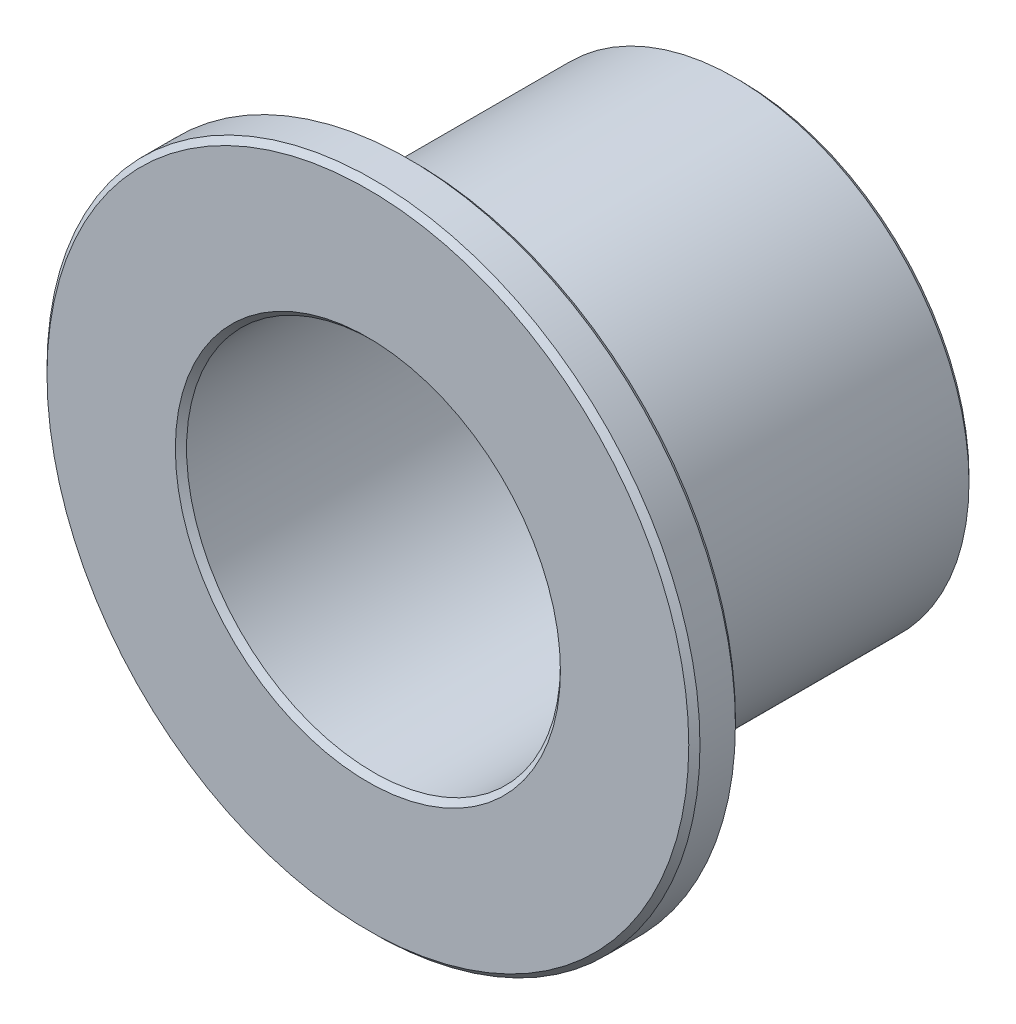
ISO-10303-21;
HEADER;
FILE_DESCRIPTION(('STEP AP214'),'2;1');
FILE_NAME('part.step','',(''),(''),'','','');
FILE_SCHEMA(('AUTOMOTIVE_DESIGN { 1 0 10303 214 1 1 1 1 }'));
ENDSEC;
DATA;
#1=APPLICATION_CONTEXT('core data for automotive mechanical design processes');
#2=APPLICATION_PROTOCOL_DEFINITION('international standard','automotive_design',2000,#1);
#3=PRODUCT_CONTEXT('',#1,'mechanical');
#4=PRODUCT('Part','Part','',(#3));
#5=PRODUCT_RELATED_PRODUCT_CATEGORY('part','',(#4));
#6=PRODUCT_DEFINITION_FORMATION('','',#4);
#7=PRODUCT_DEFINITION_CONTEXT('part definition',#1,'design');
#8=PRODUCT_DEFINITION('design','',#6,#7);
#9=PRODUCT_DEFINITION_SHAPE('','',#8);
#10=(LENGTH_UNIT() NAMED_UNIT(*) SI_UNIT(.MILLI.,.METRE.));
#11=(NAMED_UNIT(*) PLANE_ANGLE_UNIT() SI_UNIT($,.RADIAN.));
#12=(NAMED_UNIT(*) SI_UNIT($,.STERADIAN.) SOLID_ANGLE_UNIT());
#13=UNCERTAINTY_MEASURE_WITH_UNIT(LENGTH_MEASURE(1.E-05),#10,'distance_accuracy_value','');
#14=(GEOMETRIC_REPRESENTATION_CONTEXT(3) GLOBAL_UNCERTAINTY_ASSIGNED_CONTEXT((#13)) GLOBAL_UNIT_ASSIGNED_CONTEXT((#10,
#11,#12)) REPRESENTATION_CONTEXT('',''));
#15=CARTESIAN_POINT('',(0.,0.,0.));
#16=DIRECTION('',(0.,0.,1.));
#17=DIRECTION('',(1.,0.,0.));
#18=AXIS2_PLACEMENT_3D('',#15,#16,#17);
#19=CARTESIAN_POINT('',(0.,0.,4.7625));
#20=DIRECTION('',(0.,0.,1.));
#21=DIRECTION('',(1.,0.,0.));
#22=AXIS2_PLACEMENT_3D('',#19,#20,#21);
#23=CYLINDRICAL_SURFACE('',#22,11.1125);
#24=CARTESIAN_POINT('',(0.,0.,6.159119));
#25=DIRECTION('',(0.,0.,1.));
#26=DIRECTION('',(1.,0.,0.));
#27=AXIS2_PLACEMENT_3D('',#24,#25,#26);
#28=CIRCLE('',#27,11.1125);
#29=CARTESIAN_POINT('',(11.1125,0.,6.159119));
#30=VERTEX_POINT('',#29);
#31=EDGE_CURVE('E71',#30,#30,#28,.F.);
#32=ORIENTED_EDGE('',*,*,#31,.T.);
#33=EDGE_LOOP('',(#32));
#34=FACE_BOUND('',#33,.T.);
#35=CARTESIAN_POINT('',(0.,0.,4.953381));
#36=DIRECTION('',(0.,0.,1.));
#37=DIRECTION('',(1.,0.,0.));
#38=AXIS2_PLACEMENT_3D('',#35,#36,#37);
#39=CIRCLE('',#38,11.1125);
#40=CARTESIAN_POINT('',(11.1125,0.,4.953381));
#41=VERTEX_POINT('',#40);
#42=EDGE_CURVE('E75',#41,#41,#39,.T.);
#43=ORIENTED_EDGE('',*,*,#42,.T.);
#44=EDGE_LOOP('',(#43));
#45=FACE_BOUND('',#44,.T.);
#46=ADVANCED_FACE('F39',(#34,#45),#23,.T.);
#47=CARTESIAN_POINT('',(0.,0.,4.7625));
#48=DIRECTION('',(0.,0.,1.));
#49=DIRECTION('',(1.,0.,0.));
#50=AXIS2_PLACEMENT_3D('',#47,#48,#49);
#51=PLANE('',#50);
#52=CARTESIAN_POINT('',(0.,0.,4.7625));
#53=DIRECTION('',(0.,0.,1.));
#54=DIRECTION('',(1.,0.,0.));
#55=AXIS2_PLACEMENT_3D('',#52,#53,#54);
#56=CIRCLE('',#55,10.921619);
#57=CARTESIAN_POINT('',(10.921619,0.,4.7625));
#58=VERTEX_POINT('',#57);
#59=EDGE_CURVE('E63',#58,#58,#56,.F.);
#60=ORIENTED_EDGE('',*,*,#59,.T.);
#61=EDGE_LOOP('',(#60));
#62=FACE_BOUND('',#61,.T.);
#63=CARTESIAN_POINT('',(0.,0.,4.7625));
#64=DIRECTION('',(0.,0.,1.));
#65=DIRECTION('',(1.,0.,0.));
#66=AXIS2_PLACEMENT_3D('',#63,#64,#65);
#67=CIRCLE('',#66,8.141081);
#68=CARTESIAN_POINT('',(8.141081,0.,4.7625));
#69=VERTEX_POINT('',#68);
#70=EDGE_CURVE('E67',#69,#69,#67,.T.);
#71=ORIENTED_EDGE('',*,*,#70,.T.);
#72=EDGE_LOOP('',(#71));
#73=FACE_BOUND('',#72,.T.);
#74=ADVANCED_FACE('F111',(#62,#73),#51,.F.);
#75=CARTESIAN_POINT('',(0.,0.,6.35));
#76=DIRECTION('',(0.,0.,1.));
#77=DIRECTION('',(1.,0.,0.));
#78=AXIS2_PLACEMENT_3D('',#75,#76,#77);
#79=PLANE('',#78);
#80=CARTESIAN_POINT('',(0.,0.,6.35));
#81=DIRECTION('',(0.,0.,1.));
#82=DIRECTION('',(1.,0.,0.));
#83=AXIS2_PLACEMENT_3D('',#80,#81,#82);
#84=CIRCLE('',#83,6.553581);
#85=CARTESIAN_POINT('',(6.553581,0.,6.35));
#86=VERTEX_POINT('',#85);
#87=EDGE_CURVE('E79',#86,#86,#84,.F.);
#88=ORIENTED_EDGE('',*,*,#87,.T.);
#89=EDGE_LOOP('',(#88));
#90=FACE_BOUND('',#89,.T.);
#91=CARTESIAN_POINT('',(0.,0.,6.35));
#92=DIRECTION('',(0.,0.,1.));
#93=DIRECTION('',(1.,0.,0.));
#94=AXIS2_PLACEMENT_3D('',#91,#92,#93);
#95=CIRCLE('',#94,10.921619);
#96=CARTESIAN_POINT('',(10.921619,0.,6.35));
#97=VERTEX_POINT('',#96);
#98=EDGE_CURVE('E83',#97,#97,#95,.T.);
#99=ORIENTED_EDGE('',*,*,#98,.T.);
#100=EDGE_LOOP('',(#99));
#101=FACE_BOUND('',#100,.T.);
#102=ADVANCED_FACE('F117',(#90,#101),#79,.T.);
#103=CARTESIAN_POINT('',(0.,0.,4.7625));
#104=DIRECTION('',(0.,0.,1.));
#105=DIRECTION('',(1.,0.,0.));
#106=AXIS2_PLACEMENT_3D('',#103,#104,#105);
#107=CYLINDRICAL_SURFACE('',#106,6.3627);
#108=CARTESIAN_POINT('',(0.,0.,6.159119));
#109=DIRECTION('',(0.,0.,1.));
#110=DIRECTION('',(1.,0.,0.));
#111=AXIS2_PLACEMENT_3D('',#108,#109,#110);
#112=CIRCLE('',#111,6.3627);
#113=CARTESIAN_POINT('',(6.3627,0.,6.159119));
#114=VERTEX_POINT('',#113);
#115=EDGE_CURVE('E87',#114,#114,#112,.T.);
#116=ORIENTED_EDGE('',*,*,#115,.T.);
#117=EDGE_LOOP('',(#116));
#118=FACE_BOUND('',#117,.T.);
#119=CARTESIAN_POINT('',(0.,0.,-6.159119));
#120=DIRECTION('',(0.,0.,1.));
#121=DIRECTION('',(1.,0.,0.));
#122=AXIS2_PLACEMENT_3D('',#119,#120,#121);
#123=CIRCLE('',#122,6.3627);
#124=CARTESIAN_POINT('',(6.3627,0.,-6.159119));
#125=VERTEX_POINT('',#124);
#126=EDGE_CURVE('E91',#125,#125,#123,.F.);
#127=ORIENTED_EDGE('',*,*,#126,.T.);
#128=EDGE_LOOP('',(#127));
#129=FACE_BOUND('',#128,.T.);
#130=ADVANCED_FACE('F96',(#118,#129),#107,.F.);
#131=CARTESIAN_POINT('',(0.,0.,-6.35));
#132=DIRECTION('',(0.,0.,1.));
#133=DIRECTION('',(1.,0.,0.));
#134=AXIS2_PLACEMENT_3D('',#131,#132,#133);
#135=CYLINDRICAL_SURFACE('',#134,7.9502);
#136=CARTESIAN_POINT('',(0.,0.,4.571619));
#137=DIRECTION('',(0.,0.,1.));
#138=DIRECTION('',(1.,0.,0.));
#139=AXIS2_PLACEMENT_3D('',#136,#137,#138);
#140=CIRCLE('',#139,7.9502);
#141=CARTESIAN_POINT('',(7.9502,0.,4.571619));
#142=VERTEX_POINT('',#141);
#143=EDGE_CURVE('E52',#142,#142,#140,.F.);
#144=ORIENTED_EDGE('',*,*,#143,.T.);
#145=EDGE_LOOP('',(#144));
#146=FACE_BOUND('',#145,.T.);
#147=CARTESIAN_POINT('',(0.,0.,-6.159119));
#148=DIRECTION('',(0.,0.,1.));
#149=DIRECTION('',(1.,0.,0.));
#150=AXIS2_PLACEMENT_3D('',#147,#148,#149);
#151=CIRCLE('',#150,7.9502);
#152=CARTESIAN_POINT('',(7.9502,0.,-6.159119));
#153=VERTEX_POINT('',#152);
#154=EDGE_CURVE('E57',#153,#153,#151,.T.);
#155=ORIENTED_EDGE('',*,*,#154,.T.);
#156=EDGE_LOOP('',(#155));
#157=FACE_BOUND('',#156,.T.);
#158=ADVANCED_FACE('F179',(#146,#157),#135,.T.);
#159=CARTESIAN_POINT('',(0.,0.,-6.35));
#160=DIRECTION('',(0.,0.,1.));
#161=DIRECTION('',(1.,0.,0.));
#162=AXIS2_PLACEMENT_3D('',#159,#160,#161);
#163=PLANE('',#162);
#164=CARTESIAN_POINT('',(0.,0.,-6.35));
#165=DIRECTION('',(0.,0.,1.));
#166=DIRECTION('',(1.,0.,0.));
#167=AXIS2_PLACEMENT_3D('',#164,#165,#166);
#168=CIRCLE('',#167,6.553581);
#169=CARTESIAN_POINT('',(6.553581,0.,-6.35));
#170=VERTEX_POINT('',#169);
#171=EDGE_CURVE('E10',#170,#170,#168,.T.);
#172=ORIENTED_EDGE('',*,*,#171,.T.);
#173=EDGE_LOOP('',(#172));
#174=FACE_BOUND('',#173,.T.);
#175=CARTESIAN_POINT('',(0.,0.,-6.35));
#176=DIRECTION('',(0.,0.,1.));
#177=DIRECTION('',(1.,0.,0.));
#178=AXIS2_PLACEMENT_3D('',#175,#176,#177);
#179=CIRCLE('',#178,7.759319);
#180=CARTESIAN_POINT('',(7.759319,0.,-6.35));
#181=VERTEX_POINT('',#180);
#182=EDGE_CURVE('E47',#181,#181,#179,.F.);
#183=ORIENTED_EDGE('',*,*,#182,.T.);
#184=EDGE_LOOP('',(#183));
#185=FACE_BOUND('',#184,.T.);
#186=ADVANCED_FACE('F127',(#174,#185),#163,.F.);
#187=CARTESIAN_POINT('',(0.,0.,6.159119));
#188=DIRECTION('',(0.,0.,1.));
#189=DIRECTION('',(1.,0.,0.));
#190=AXIS2_PLACEMENT_3D('',#187,#188,#189);
#191=CONICAL_SURFACE('',#190,6.3627,0.785398163397453);
#192=ORIENTED_EDGE('',*,*,#87,.F.);
#193=EDGE_LOOP('',(#192));
#194=FACE_BOUND('',#193,.T.);
#195=ORIENTED_EDGE('',*,*,#115,.F.);
#196=EDGE_LOOP('',(#195));
#197=FACE_BOUND('',#196,.T.);
#198=ADVANCED_FACE('F123',(#194,#197),#191,.F.);
#199=CARTESIAN_POINT('',(0.,0.,6.35));
#200=DIRECTION('',(0.,0.,-1.));
#201=DIRECTION('',(-1.,0.,0.));
#202=AXIS2_PLACEMENT_3D('',#199,#200,#201);
#203=CONICAL_SURFACE('',#202,10.921619,0.785398163397457);
#204=ORIENTED_EDGE('',*,*,#31,.F.);
#205=EDGE_LOOP('',(#204));
#206=FACE_BOUND('',#205,.T.);
#207=ORIENTED_EDGE('',*,*,#98,.F.);
#208=EDGE_LOOP('',(#207));
#209=FACE_BOUND('',#208,.T.);
#210=ADVANCED_FACE('F126',(#206,#209),#203,.T.);
#211=CARTESIAN_POINT('',(0.,0.,4.953381));
#212=DIRECTION('',(0.,0.,1.));
#213=DIRECTION('',(1.,0.,0.));
#214=AXIS2_PLACEMENT_3D('',#211,#212,#213);
#215=CONICAL_SURFACE('',#214,11.1125,0.785398163397453);
#216=ORIENTED_EDGE('',*,*,#59,.F.);
#217=EDGE_LOOP('',(#216));
#218=FACE_BOUND('',#217,.T.);
#219=ORIENTED_EDGE('',*,*,#42,.F.);
#220=EDGE_LOOP('',(#219));
#221=FACE_BOUND('',#220,.T.);
#222=ADVANCED_FACE('F107',(#218,#221),#215,.T.);
#223=CARTESIAN_POINT('',(0.,0.,4.7625));
#224=DIRECTION('',(0.,0.,1.));
#225=DIRECTION('',(1.,0.,0.));
#226=AXIS2_PLACEMENT_3D('',#223,#224,#225);
#227=CONICAL_SURFACE('',#226,8.141081,0.785398163397448);
#228=ORIENTED_EDGE('',*,*,#143,.F.);
#229=EDGE_LOOP('',(#228));
#230=FACE_BOUND('',#229,.T.);
#231=ORIENTED_EDGE('',*,*,#70,.F.);
#232=EDGE_LOOP('',(#231));
#233=FACE_BOUND('',#232,.T.);
#234=ADVANCED_FACE('F101',(#230,#233),#227,.T.);
#235=CARTESIAN_POINT('',(0.,0.,-6.35));
#236=DIRECTION('',(0.,0.,-1.));
#237=DIRECTION('',(-1.,0.,0.));
#238=AXIS2_PLACEMENT_3D('',#235,#236,#237);
#239=CONICAL_SURFACE('',#238,6.553581,0.785398163397446);
#240=ORIENTED_EDGE('',*,*,#126,.F.);
#241=EDGE_LOOP('',(#240));
#242=FACE_BOUND('',#241,.T.);
#243=ORIENTED_EDGE('',*,*,#171,.F.);
#244=EDGE_LOOP('',(#243));
#245=FACE_BOUND('',#244,.T.);
#246=ADVANCED_FACE('F98',(#242,#245),#239,.F.);
#247=CARTESIAN_POINT('',(0.,0.,-6.159119));
#248=DIRECTION('',(0.,0.,1.));
#249=DIRECTION('',(1.,0.,0.));
#250=AXIS2_PLACEMENT_3D('',#247,#248,#249);
#251=CONICAL_SURFACE('',#250,7.9502,0.785398163397448);
#252=ORIENTED_EDGE('',*,*,#182,.F.);
#253=EDGE_LOOP('',(#252));
#254=FACE_BOUND('',#253,.T.);
#255=ORIENTED_EDGE('',*,*,#154,.F.);
#256=EDGE_LOOP('',(#255));
#257=FACE_BOUND('',#256,.T.);
#258=ADVANCED_FACE('F41',(#254,#257),#251,.T.);
#259=CLOSED_SHELL('',(#46,#74,#102,#130,#158,#186,#198,#210,#222,#234,#246,#258));
#260=MANIFOLD_SOLID_BREP('B2',#259);
#261=ADVANCED_BREP_SHAPE_REPRESENTATION('',(#18,#260),#14);
#262=SHAPE_DEFINITION_REPRESENTATION(#9,#261);
ENDSEC;
END-ISO-10303-21;
